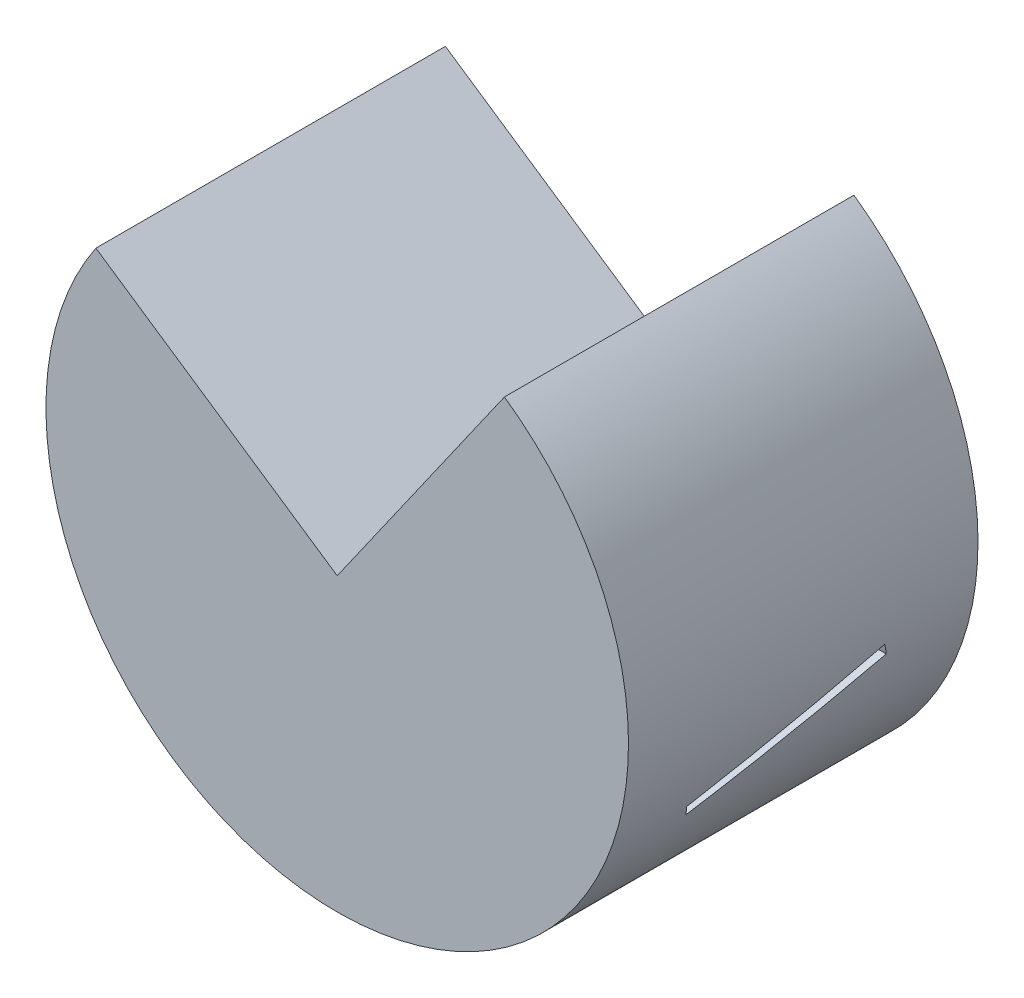
ISO-10303-21;
HEADER;
FILE_DESCRIPTION(('STEP AP214'),'2;1');
FILE_NAME('part.step','',(''),(''),'','','');
FILE_SCHEMA(('AUTOMOTIVE_DESIGN { 1 0 10303 214 1 1 1 1 }'));
ENDSEC;
DATA;
#1=APPLICATION_CONTEXT('core data for automotive mechanical design processes');
#2=APPLICATION_PROTOCOL_DEFINITION('international standard','automotive_design',2000,#1);
#3=PRODUCT_CONTEXT('',#1,'mechanical');
#4=PRODUCT('Part','Part','',(#3));
#5=PRODUCT_RELATED_PRODUCT_CATEGORY('part','',(#4));
#6=PRODUCT_DEFINITION_FORMATION('','',#4);
#7=PRODUCT_DEFINITION_CONTEXT('part definition',#1,'design');
#8=PRODUCT_DEFINITION('design','',#6,#7);
#9=PRODUCT_DEFINITION_SHAPE('','',#8);
#10=(LENGTH_UNIT() NAMED_UNIT(*) SI_UNIT(.MILLI.,.METRE.));
#11=(NAMED_UNIT(*) PLANE_ANGLE_UNIT() SI_UNIT($,.RADIAN.));
#12=(NAMED_UNIT(*) SI_UNIT($,.STERADIAN.) SOLID_ANGLE_UNIT());
#13=UNCERTAINTY_MEASURE_WITH_UNIT(LENGTH_MEASURE(1.E-05),#10,'distance_accuracy_value','');
#14=(GEOMETRIC_REPRESENTATION_CONTEXT(3) GLOBAL_UNCERTAINTY_ASSIGNED_CONTEXT((#13)) GLOBAL_UNIT_ASSIGNED_CONTEXT((#10,
#11,#12)) REPRESENTATION_CONTEXT('',''));
#15=CARTESIAN_POINT('',(0.,0.,0.));
#16=DIRECTION('',(0.,0.,1.));
#17=DIRECTION('',(1.,0.,0.));
#18=AXIS2_PLACEMENT_3D('',#15,#16,#17);
#19=CARTESIAN_POINT('',(0.,0.,-15.));
#20=DIRECTION('',(0.,0.,1.));
#21=DIRECTION('',(1.,0.,0.));
#22=AXIS2_PLACEMENT_3D('',#19,#20,#21);
#23=CYLINDRICAL_SURFACE('',#22,25.);
#24=CARTESIAN_POINT('',(0.,0.,-23.3855006706003));
#25=DIRECTION('',(0.,-0.955933699019995,-0.293582634155954));
#26=DIRECTION('',(0.,-0.293582634155954,0.955933699019996));
#27=AXIS2_PLACEMENT_3D('',#24,#25,#26);
#28=ELLIPSE('',#27,85.1549004997338,25.);
#29=CARTESIAN_POINT('',(23.0500038767903,-9.67973766586437,8.13266953410442));
#30=VERTEX_POINT('',#29);
#31=CARTESIAN_POINT('',(24.5254837629832,-4.84774650653755,-7.60076509443536));
#32=VERTEX_POINT('',#31);
#33=EDGE_CURVE('E13',#30,#32,#28,.F.);
#34=ORIENTED_EDGE('',*,*,#33,.F.);
#35=CARTESIAN_POINT('',(0.,0.,11.1054728621976));
#36=DIRECTION('',(0.,0.293582634155955,-0.955933699019995));
#37=DIRECTION('',(0.,0.955933699019995,0.293582634155955));
#38=AXIS2_PLACEMENT_3D('',#35,#36,#37);
#39=ELLIPSE('',#38,26.1524413519782,25.);
#40=CARTESIAN_POINT('',(23.4285134899351,-8.72380396684438,8.42625216826037));
#41=VERTEX_POINT('',#40);
#42=EDGE_CURVE('E57',#30,#41,#39,.F.);
#43=ORIENTED_EDGE('',*,*,#42,.T.);
#44=CARTESIAN_POINT('',(0.,0.,-19.979304650611));
#45=DIRECTION('',(0.,-0.955933699019995,-0.293582634155954));
#46=DIRECTION('',(0.,-0.293582634155954,0.955933699019996));
#47=AXIS2_PLACEMENT_3D('',#44,#45,#46);
#48=ELLIPSE('',#47,85.1549004997338,25.);
#49=CARTESIAN_POINT('',(24.6952180203221,-3.89181280751756,-7.30718246027941));
#50=VERTEX_POINT('',#49);
#51=EDGE_CURVE('E109',#41,#50,#48,.F.);
#52=ORIENTED_EDGE('',*,*,#51,.T.);
#53=CARTESIAN_POINT('',(0.,0.,-6.11194406995566));
#54=DIRECTION('',(0.,-0.293582634155955,0.955933699019995));
#55=DIRECTION('',(0.,0.955933699019995,0.293582634155955));
#56=AXIS2_PLACEMENT_3D('',#53,#54,#55);
#57=ELLIPSE('',#56,26.1524413519782,25.);
#58=EDGE_CURVE('E104',#50,#32,#57,.F.);
#59=ORIENTED_EDGE('',*,*,#58,.T.);
#60=EDGE_LOOP('',(#34,#43,#52,#59));
#61=FACE_BOUND('',#60,.T.);
#62=CARTESIAN_POINT('',(-24.5254837629832,-4.84774650653755,-7.60076509443536));
#63=VERTEX_POINT('',#62);
#64=CARTESIAN_POINT('',(-23.0500038767903,-9.67973766586437,8.13266953410442));
#65=VERTEX_POINT('',#64);
#66=EDGE_CURVE('E52',#63,#65,#28,.F.);
#67=ORIENTED_EDGE('',*,*,#66,.F.);
#68=CARTESIAN_POINT('',(-24.6952180203221,-3.89181280751756,-7.30718246027941));
#69=VERTEX_POINT('',#68);
#70=EDGE_CURVE('E111',#63,#69,#57,.F.);
#71=ORIENTED_EDGE('',*,*,#70,.T.);
#72=CARTESIAN_POINT('',(-23.4285134899351,-8.72380396684438,8.42625216826037));
#73=VERTEX_POINT('',#72);
#74=EDGE_CURVE('E117',#69,#73,#48,.F.);
#75=ORIENTED_EDGE('',*,*,#74,.T.);
#76=EDGE_CURVE('E124',#73,#65,#39,.F.);
#77=ORIENTED_EDGE('',*,*,#76,.T.);
#78=EDGE_LOOP('',(#67,#71,#75,#77));
#79=FACE_BOUND('',#78,.T.);
#80=CARTESIAN_POINT('',(0.,0.,15.));
#81=DIRECTION('',(0.,0.,1.));
#82=DIRECTION('',(1.,0.,0.));
#83=AXIS2_PLACEMENT_3D('',#80,#81,#82);
#84=CIRCLE('',#83,25.);
#85=CARTESIAN_POINT('',(-20.7141253166429,13.9973216140237,15.));
#86=VERTEX_POINT('',#85);
#87=CARTESIAN_POINT('',(14.3531749800476,20.4691565041683,15.));
#88=VERTEX_POINT('',#87);
#89=EDGE_CURVE('E129',#86,#88,#84,.T.);
#90=ORIENTED_EDGE('',*,*,#89,.F.);
#91=DIRECTION('',(0.,0.,1.));
#92=VECTOR('',#91,1.);
#93=CARTESIAN_POINT('',(-20.7141253166429,13.9973216140237,-15.));
#94=LINE('',#93,#92);
#95=CARTESIAN_POINT('',(-20.7141253166429,13.9973216140237,-15.));
#96=VERTEX_POINT('',#95);
#97=EDGE_CURVE('E133',#96,#86,#94,.T.);
#98=ORIENTED_EDGE('',*,*,#97,.F.);
#99=CARTESIAN_POINT('',(0.,0.,-15.));
#100=DIRECTION('',(0.,0.,1.));
#101=DIRECTION('',(1.,0.,0.));
#102=AXIS2_PLACEMENT_3D('',#99,#100,#101);
#103=CIRCLE('',#102,25.);
#104=CARTESIAN_POINT('',(14.3531749800476,20.4691565041683,-15.));
#105=VERTEX_POINT('',#104);
#106=EDGE_CURVE('E126',#96,#105,#103,.T.);
#107=ORIENTED_EDGE('',*,*,#106,.T.);
#108=DIRECTION('',(0.,0.,1.));
#109=VECTOR('',#108,1.);
#110=CARTESIAN_POINT('',(14.3531749800476,20.4691565041683,-15.));
#111=LINE('',#110,#109);
#112=EDGE_CURVE('E138',#105,#88,#111,.T.);
#113=ORIENTED_EDGE('',*,*,#112,.T.);
#114=EDGE_LOOP('',(#90,#98,#107,#113));
#115=FACE_BOUND('',#114,.T.);
#116=ADVANCED_FACE('F49',(#61,#79,#115),#23,.T.);
#117=CARTESIAN_POINT('',(0.,0.,-15.));
#118=DIRECTION('',(0.,0.,1.));
#119=DIRECTION('',(1.,0.,0.));
#120=AXIS2_PLACEMENT_3D('',#117,#118,#119);
#121=PLANE('',#120);
#122=DIRECTION('',(-0.828565012665715,0.559892864560947,0.));
#123=VECTOR('',#122,1.);
#124=CARTESIAN_POINT('',(0.,0.,-15.));
#125=LINE('',#124,#123);
#126=CARTESIAN_POINT('',(0.,0.,-15.));
#127=VERTEX_POINT('',#126);
#128=EDGE_CURVE('E145',#127,#96,#125,.T.);
#129=ORIENTED_EDGE('',*,*,#128,.F.);
#130=DIRECTION('',(0.574126999201903,0.818766260166733,0.));
#131=VECTOR('',#130,1.);
#132=CARTESIAN_POINT('',(0.,0.,-15.));
#133=LINE('',#132,#131);
#134=EDGE_CURVE('E139',#127,#105,#133,.T.);
#135=ORIENTED_EDGE('',*,*,#134,.T.);
#136=ORIENTED_EDGE('',*,*,#106,.F.);
#137=EDGE_LOOP('',(#129,#135,#136));
#138=FACE_BOUND('',#137,.T.);
#139=ADVANCED_FACE('F163',(#138),#121,.F.);
#140=CARTESIAN_POINT('',(0.,0.,15.));
#141=DIRECTION('',(0.,0.,1.));
#142=DIRECTION('',(1.,0.,0.));
#143=AXIS2_PLACEMENT_3D('',#140,#141,#142);
#144=PLANE('',#143);
#145=DIRECTION('',(0.574126999201903,0.818766260166733,0.));
#146=VECTOR('',#145,1.);
#147=CARTESIAN_POINT('',(0.,0.,15.));
#148=LINE('',#147,#146);
#149=CARTESIAN_POINT('',(0.,0.,15.));
#150=VERTEX_POINT('',#149);
#151=EDGE_CURVE('E143',#150,#88,#148,.T.);
#152=ORIENTED_EDGE('',*,*,#151,.F.);
#153=DIRECTION('',(-0.828565012665715,0.559892864560947,0.));
#154=VECTOR('',#153,1.);
#155=CARTESIAN_POINT('',(0.,0.,15.));
#156=LINE('',#155,#154);
#157=EDGE_CURVE('E146',#150,#86,#156,.T.);
#158=ORIENTED_EDGE('',*,*,#157,.T.);
#159=ORIENTED_EDGE('',*,*,#89,.T.);
#160=EDGE_LOOP('',(#152,#158,#159));
#161=FACE_BOUND('',#160,.T.);
#162=ADVANCED_FACE('F169',(#161),#144,.T.);
#163=CARTESIAN_POINT('',(0.,0.,-15.));
#164=DIRECTION('',(0.559892864560947,0.828565012665715,0.));
#165=DIRECTION('',(-0.828565012665715,0.559892864560947,0.));
#166=AXIS2_PLACEMENT_3D('',#163,#164,#165);
#167=PLANE('',#166);
#168=ORIENTED_EDGE('',*,*,#157,.F.);
#169=DIRECTION('',(0.,0.,1.));
#170=VECTOR('',#169,1.);
#171=CARTESIAN_POINT('',(0.,0.,-15.));
#172=LINE('',#171,#170);
#173=EDGE_CURVE('E135',#127,#150,#172,.T.);
#174=ORIENTED_EDGE('',*,*,#173,.F.);
#175=ORIENTED_EDGE('',*,*,#128,.T.);
#176=ORIENTED_EDGE('',*,*,#97,.T.);
#177=EDGE_LOOP('',(#168,#174,#175,#176));
#178=FACE_BOUND('',#177,.T.);
#179=ADVANCED_FACE('F171',(#178),#167,.T.);
#180=CARTESIAN_POINT('',(0.,0.,-15.));
#181=DIRECTION('',(0.818766260166733,-0.574126999201903,0.));
#182=DIRECTION('',(0.574126999201903,0.818766260166733,0.));
#183=AXIS2_PLACEMENT_3D('',#180,#181,#182);
#184=PLANE('',#183);
#185=ORIENTED_EDGE('',*,*,#151,.T.);
#186=ORIENTED_EDGE('',*,*,#112,.F.);
#187=ORIENTED_EDGE('',*,*,#134,.F.);
#188=ORIENTED_EDGE('',*,*,#173,.T.);
#189=EDGE_LOOP('',(#185,#186,#187,#188));
#190=FACE_BOUND('',#189,.T.);
#191=ADVANCED_FACE('F174',(#190),#184,.F.);
#192=CARTESIAN_POINT('',(-25.,-9.67973766586437,8.13266953410442));
#193=DIRECTION('',(0.,-0.955933699019995,-0.293582634155954));
#194=DIRECTION('',(0.,0.293582634155954,-0.955933699019996));
#195=AXIS2_PLACEMENT_3D('',#192,#193,#194);
#196=PLANE('',#195);
#197=ORIENTED_EDGE('',*,*,#33,.T.);
#198=DIRECTION('',(1.,0.,0.));
#199=VECTOR('',#198,1.);
#200=CARTESIAN_POINT('',(-25.,-4.84774650653755,-7.60076509443536));
#201=LINE('',#200,#199);
#202=EDGE_CURVE('E64',#63,#32,#201,.T.);
#203=ORIENTED_EDGE('',*,*,#202,.F.);
#204=ORIENTED_EDGE('',*,*,#66,.T.);
#205=DIRECTION('',(1.,0.,0.));
#206=VECTOR('',#205,1.);
#207=CARTESIAN_POINT('',(-25.,-9.67973766586437,8.13266953410442));
#208=LINE('',#207,#206);
#209=EDGE_CURVE('E149',#65,#30,#208,.T.);
#210=ORIENTED_EDGE('',*,*,#209,.T.);
#211=EDGE_LOOP('',(#197,#203,#204,#210));
#212=FACE_BOUND('',#211,.T.);
#213=ADVANCED_FACE('F158',(#212),#196,.F.);
#214=CARTESIAN_POINT('',(-25.,-9.67973766586437,8.13266953410442));
#215=DIRECTION('',(0.,0.293582634155955,-0.955933699019995));
#216=DIRECTION('',(0.,0.955933699019995,0.293582634155955));
#217=AXIS2_PLACEMENT_3D('',#214,#215,#216);
#218=PLANE('',#217);
#219=DIRECTION('',(1.,0.,0.));
#220=VECTOR('',#219,1.);
#221=CARTESIAN_POINT('',(-25.,-8.72380396684438,8.42625216826037));
#222=LINE('',#221,#220);
#223=EDGE_CURVE('E119',#73,#41,#222,.T.);
#224=ORIENTED_EDGE('',*,*,#223,.T.);
#225=ORIENTED_EDGE('',*,*,#42,.F.);
#226=ORIENTED_EDGE('',*,*,#209,.F.);
#227=ORIENTED_EDGE('',*,*,#76,.F.);
#228=EDGE_LOOP('',(#224,#225,#226,#227));
#229=FACE_BOUND('',#228,.T.);
#230=ADVANCED_FACE('F160',(#229),#218,.T.);
#231=CARTESIAN_POINT('',(-25.,-8.72380396684438,8.42625216826037));
#232=DIRECTION('',(0.,-0.955933699019995,-0.293582634155954));
#233=DIRECTION('',(0.,0.293582634155954,-0.955933699019996));
#234=AXIS2_PLACEMENT_3D('',#231,#232,#233);
#235=PLANE('',#234);
#236=ORIENTED_EDGE('',*,*,#223,.F.);
#237=ORIENTED_EDGE('',*,*,#74,.F.);
#238=DIRECTION('',(1.,0.,0.));
#239=VECTOR('',#238,1.);
#240=CARTESIAN_POINT('',(-25.,-3.89181280751756,-7.30718246027941));
#241=LINE('',#240,#239);
#242=EDGE_CURVE('E68',#69,#50,#241,.T.);
#243=ORIENTED_EDGE('',*,*,#242,.T.);
#244=ORIENTED_EDGE('',*,*,#51,.F.);
#245=EDGE_LOOP('',(#236,#237,#243,#244));
#246=FACE_BOUND('',#245,.T.);
#247=ADVANCED_FACE('F114',(#246),#235,.T.);
#248=CARTESIAN_POINT('',(-25.,-3.89181280751756,-7.30718246027941));
#249=DIRECTION('',(0.,-0.293582634155955,0.955933699019995));
#250=DIRECTION('',(0.,-0.955933699019995,-0.293582634155955));
#251=AXIS2_PLACEMENT_3D('',#248,#249,#250);
#252=PLANE('',#251);
#253=ORIENTED_EDGE('',*,*,#242,.F.);
#254=ORIENTED_EDGE('',*,*,#70,.F.);
#255=ORIENTED_EDGE('',*,*,#202,.T.);
#256=ORIENTED_EDGE('',*,*,#58,.F.);
#257=EDGE_LOOP('',(#253,#254,#255,#256));
#258=FACE_BOUND('',#257,.T.);
#259=ADVANCED_FACE('F105',(#258),#252,.T.);
#260=CLOSED_SHELL('',(#116,#139,#162,#179,#191,#213,#230,#247,#259));
#261=MANIFOLD_SOLID_BREP('B2',#260);
#262=ADVANCED_BREP_SHAPE_REPRESENTATION('',(#18,#261),#14);
#263=SHAPE_DEFINITION_REPRESENTATION(#9,#262);
ENDSEC;
END-ISO-10303-21;
